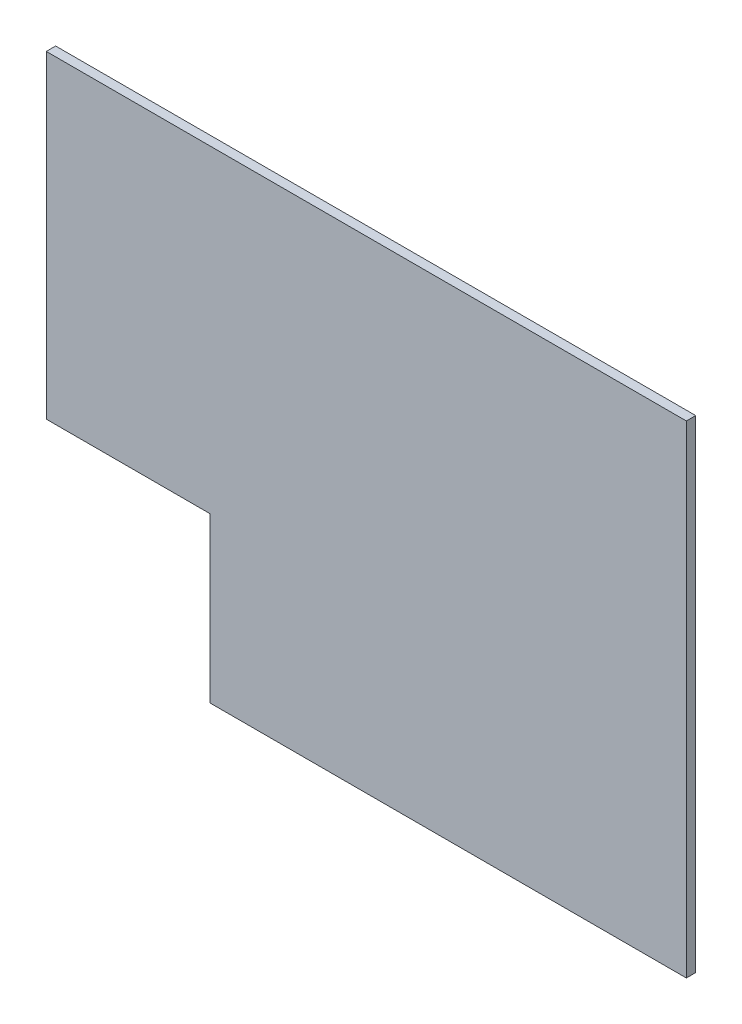
ISO-10303-21;
HEADER;
FILE_DESCRIPTION(('STEP AP214'),'2;1');
FILE_NAME('part.step','',(''),(''),'','','');
FILE_SCHEMA(('AUTOMOTIVE_DESIGN { 1 0 10303 214 1 1 1 1 }'));
ENDSEC;
DATA;
#1=APPLICATION_CONTEXT('core data for automotive mechanical design processes');
#2=APPLICATION_PROTOCOL_DEFINITION('international standard','automotive_design',2000,#1);
#3=PRODUCT_CONTEXT('',#1,'mechanical');
#4=PRODUCT('Part','Part','',(#3));
#5=PRODUCT_RELATED_PRODUCT_CATEGORY('part','',(#4));
#6=PRODUCT_DEFINITION_FORMATION('','',#4);
#7=PRODUCT_DEFINITION_CONTEXT('part definition',#1,'design');
#8=PRODUCT_DEFINITION('design','',#6,#7);
#9=PRODUCT_DEFINITION_SHAPE('','',#8);
#10=(LENGTH_UNIT() NAMED_UNIT(*) SI_UNIT(.MILLI.,.METRE.));
#11=(NAMED_UNIT(*) PLANE_ANGLE_UNIT() SI_UNIT($,.RADIAN.));
#12=(NAMED_UNIT(*) SI_UNIT($,.STERADIAN.) SOLID_ANGLE_UNIT());
#13=UNCERTAINTY_MEASURE_WITH_UNIT(LENGTH_MEASURE(1.E-05),#10,'distance_accuracy_value','');
#14=(GEOMETRIC_REPRESENTATION_CONTEXT(3) GLOBAL_UNCERTAINTY_ASSIGNED_CONTEXT((#13)) GLOBAL_UNIT_ASSIGNED_CONTEXT((#10,
#11,#12)) REPRESENTATION_CONTEXT('',''));
#15=CARTESIAN_POINT('',(0.,0.,0.));
#16=DIRECTION('',(0.,0.,1.));
#17=DIRECTION('',(1.,0.,0.));
#18=AXIS2_PLACEMENT_3D('',#15,#16,#17);
#19=CARTESIAN_POINT('',(199.461764933445,-31.9971749422643,3.));
#20=DIRECTION('',(-1.,0.,0.));
#21=DIRECTION('',(0.,-1.,0.));
#22=AXIS2_PLACEMENT_3D('',#19,#20,#21);
#23=PLANE('',#22);
#24=DIRECTION('',(0.,1.,0.));
#25=VECTOR('',#24,1.);
#26=CARTESIAN_POINT('',(199.461764933445,-31.9971749422643,0.));
#27=LINE('',#26,#25);
#28=CARTESIAN_POINT('',(199.461764933445,-31.9971749422643,0.));
#29=VERTEX_POINT('',#28);
#30=CARTESIAN_POINT('',(199.461764933445,122.502825057736,0.));
#31=VERTEX_POINT('',#30);
#32=EDGE_CURVE('E117',#29,#31,#27,.T.);
#33=ORIENTED_EDGE('',*,*,#32,.T.);
#34=DIRECTION('',(0.,0.,-1.));
#35=VECTOR('',#34,1.);
#36=CARTESIAN_POINT('',(199.461764933445,122.502825057736,3.));
#37=LINE('',#36,#35);
#38=CARTESIAN_POINT('',(199.461764933445,122.502825057736,3.));
#39=VERTEX_POINT('',#38);
#40=EDGE_CURVE('E11',#39,#31,#37,.T.);
#41=ORIENTED_EDGE('',*,*,#40,.F.);
#42=DIRECTION('',(0.,1.,0.));
#43=VECTOR('',#42,1.);
#44=CARTESIAN_POINT('',(199.461764933445,-31.9971749422643,3.));
#45=LINE('',#44,#43);
#46=CARTESIAN_POINT('',(199.461764933445,-31.9971749422643,3.));
#47=VERTEX_POINT('',#46);
#48=EDGE_CURVE('E127',#47,#39,#45,.T.);
#49=ORIENTED_EDGE('',*,*,#48,.F.);
#50=DIRECTION('',(0.,0.,-1.));
#51=VECTOR('',#50,1.);
#52=CARTESIAN_POINT('',(199.461764933445,-31.9971749422643,3.));
#53=LINE('',#52,#51);
#54=EDGE_CURVE('E113',#47,#29,#53,.T.);
#55=ORIENTED_EDGE('',*,*,#54,.T.);
#56=EDGE_LOOP('',(#33,#41,#49,#55));
#57=FACE_BOUND('',#56,.T.);
#58=ADVANCED_FACE('F33',(#57),#23,.F.);
#59=CARTESIAN_POINT('',(-5.53823506655535,122.502825057736,3.));
#60=DIRECTION('',(0.,-1.,0.));
#61=DIRECTION('',(1.,0.,0.));
#62=AXIS2_PLACEMENT_3D('',#59,#60,#61);
#63=PLANE('',#62);
#64=DIRECTION('',(-1.,0.,0.));
#65=VECTOR('',#64,1.);
#66=CARTESIAN_POINT('',(-5.53823506655535,122.502825057736,0.));
#67=LINE('',#66,#65);
#68=CARTESIAN_POINT('',(-5.53823506655535,122.502825057736,0.));
#69=VERTEX_POINT('',#68);
#70=EDGE_CURVE('E120',#31,#69,#67,.T.);
#71=ORIENTED_EDGE('',*,*,#70,.T.);
#72=DIRECTION('',(0.,0.,-1.));
#73=VECTOR('',#72,1.);
#74=CARTESIAN_POINT('',(-5.53823506655535,122.502825057736,3.));
#75=LINE('',#74,#73);
#76=CARTESIAN_POINT('',(-5.53823506655535,122.502825057736,3.));
#77=VERTEX_POINT('',#76);
#78=EDGE_CURVE('E41',#77,#69,#75,.T.);
#79=ORIENTED_EDGE('',*,*,#78,.F.);
#80=DIRECTION('',(-1.,0.,0.));
#81=VECTOR('',#80,1.);
#82=CARTESIAN_POINT('',(-5.53823506655535,122.502825057736,3.));
#83=LINE('',#82,#81);
#84=EDGE_CURVE('E86',#39,#77,#83,.T.);
#85=ORIENTED_EDGE('',*,*,#84,.F.);
#86=ORIENTED_EDGE('',*,*,#40,.T.);
#87=EDGE_LOOP('',(#71,#79,#85,#86));
#88=FACE_BOUND('',#87,.T.);
#89=ADVANCED_FACE('F151',(#88),#63,.F.);
#90=CARTESIAN_POINT('',(-5.53823506655535,122.502825057736,3.));
#91=DIRECTION('',(1.,0.,0.));
#92=DIRECTION('',(0.,0.,-1.));
#93=AXIS2_PLACEMENT_3D('',#90,#91,#92);
#94=PLANE('',#93);
#95=DIRECTION('',(0.,-1.,0.));
#96=VECTOR('',#95,1.);
#97=CARTESIAN_POINT('',(-5.53823506655535,122.502825057736,0.));
#98=LINE('',#97,#96);
#99=CARTESIAN_POINT('',(-5.53823506655535,20.5028250577357,0.));
#100=VERTEX_POINT('',#99);
#101=EDGE_CURVE('E122',#69,#100,#98,.T.);
#102=ORIENTED_EDGE('',*,*,#101,.T.);
#103=DIRECTION('',(0.,0.,-1.));
#104=VECTOR('',#103,1.);
#105=CARTESIAN_POINT('',(-5.53823506655535,20.5028250577357,3.));
#106=LINE('',#105,#104);
#107=CARTESIAN_POINT('',(-5.53823506655535,20.5028250577357,3.));
#108=VERTEX_POINT('',#107);
#109=EDGE_CURVE('E108',#108,#100,#106,.T.);
#110=ORIENTED_EDGE('',*,*,#109,.F.);
#111=DIRECTION('',(0.,-1.,0.));
#112=VECTOR('',#111,1.);
#113=CARTESIAN_POINT('',(-5.53823506655535,122.502825057736,3.));
#114=LINE('',#113,#112);
#115=EDGE_CURVE('E99',#77,#108,#114,.T.);
#116=ORIENTED_EDGE('',*,*,#115,.F.);
#117=ORIENTED_EDGE('',*,*,#78,.T.);
#118=EDGE_LOOP('',(#102,#110,#116,#117));
#119=FACE_BOUND('',#118,.T.);
#120=ADVANCED_FACE('F133',(#119),#94,.F.);
#121=CARTESIAN_POINT('',(46.9617649334447,20.5028250577357,3.));
#122=DIRECTION('',(0.,1.,0.));
#123=DIRECTION('',(0.,0.,1.));
#124=AXIS2_PLACEMENT_3D('',#121,#122,#123);
#125=PLANE('',#124);
#126=DIRECTION('',(1.,0.,0.));
#127=VECTOR('',#126,1.);
#128=CARTESIAN_POINT('',(46.9617649334447,20.5028250577357,0.));
#129=LINE('',#128,#127);
#130=CARTESIAN_POINT('',(46.9617649334447,20.5028250577357,0.));
#131=VERTEX_POINT('',#130);
#132=EDGE_CURVE('E107',#100,#131,#129,.T.);
#133=ORIENTED_EDGE('',*,*,#132,.T.);
#134=DIRECTION('',(0.,0.,-1.));
#135=VECTOR('',#134,1.);
#136=CARTESIAN_POINT('',(46.9617649334447,20.5028250577357,3.));
#137=LINE('',#136,#135);
#138=CARTESIAN_POINT('',(46.9617649334447,20.5028250577357,3.));
#139=VERTEX_POINT('',#138);
#140=EDGE_CURVE('E104',#139,#131,#137,.T.);
#141=ORIENTED_EDGE('',*,*,#140,.F.);
#142=DIRECTION('',(1.,0.,0.));
#143=VECTOR('',#142,1.);
#144=CARTESIAN_POINT('',(46.9617649334447,20.5028250577357,3.));
#145=LINE('',#144,#143);
#146=EDGE_CURVE('E93',#108,#139,#145,.T.);
#147=ORIENTED_EDGE('',*,*,#146,.F.);
#148=ORIENTED_EDGE('',*,*,#109,.T.);
#149=EDGE_LOOP('',(#133,#141,#147,#148));
#150=FACE_BOUND('',#149,.T.);
#151=ADVANCED_FACE('F105',(#150),#125,.F.);
#152=CARTESIAN_POINT('',(46.9617649334447,-31.9971749422643,3.));
#153=DIRECTION('',(1.,0.,0.));
#154=DIRECTION('',(0.,1.,0.));
#155=AXIS2_PLACEMENT_3D('',#152,#153,#154);
#156=PLANE('',#155);
#157=DIRECTION('',(0.,-1.,0.));
#158=VECTOR('',#157,1.);
#159=CARTESIAN_POINT('',(46.9617649334447,-31.9971749422643,0.));
#160=LINE('',#159,#158);
#161=CARTESIAN_POINT('',(46.9617649334447,-31.9971749422643,0.));
#162=VERTEX_POINT('',#161);
#163=EDGE_CURVE('E72',#131,#162,#160,.T.);
#164=ORIENTED_EDGE('',*,*,#163,.T.);
#165=DIRECTION('',(0.,0.,-1.));
#166=VECTOR('',#165,1.);
#167=CARTESIAN_POINT('',(46.9617649334447,-31.9971749422643,3.));
#168=LINE('',#167,#166);
#169=CARTESIAN_POINT('',(46.9617649334447,-31.9971749422643,3.));
#170=VERTEX_POINT('',#169);
#171=EDGE_CURVE('E109',#170,#162,#168,.T.);
#172=ORIENTED_EDGE('',*,*,#171,.F.);
#173=DIRECTION('',(0.,-1.,0.));
#174=VECTOR('',#173,1.);
#175=CARTESIAN_POINT('',(46.9617649334447,-31.9971749422643,3.));
#176=LINE('',#175,#174);
#177=EDGE_CURVE('E97',#139,#170,#176,.T.);
#178=ORIENTED_EDGE('',*,*,#177,.F.);
#179=ORIENTED_EDGE('',*,*,#140,.T.);
#180=EDGE_LOOP('',(#164,#172,#178,#179));
#181=FACE_BOUND('',#180,.T.);
#182=ADVANCED_FACE('F111',(#181),#156,.F.);
#183=CARTESIAN_POINT('',(46.9617649334447,-31.9971749422643,3.));
#184=DIRECTION('',(0.,1.,0.));
#185=DIRECTION('',(-1.,0.,0.));
#186=AXIS2_PLACEMENT_3D('',#183,#184,#185);
#187=PLANE('',#186);
#188=DIRECTION('',(1.,0.,0.));
#189=VECTOR('',#188,1.);
#190=CARTESIAN_POINT('',(46.9617649334447,-31.9971749422643,0.));
#191=LINE('',#190,#189);
#192=EDGE_CURVE('E78',#162,#29,#191,.T.);
#193=ORIENTED_EDGE('',*,*,#192,.T.);
#194=ORIENTED_EDGE('',*,*,#54,.F.);
#195=DIRECTION('',(1.,0.,0.));
#196=VECTOR('',#195,1.);
#197=CARTESIAN_POINT('',(46.9617649334447,-31.9971749422643,3.));
#198=LINE('',#197,#196);
#199=EDGE_CURVE('E49',#170,#47,#198,.T.);
#200=ORIENTED_EDGE('',*,*,#199,.F.);
#201=ORIENTED_EDGE('',*,*,#171,.T.);
#202=EDGE_LOOP('',(#193,#194,#200,#201));
#203=FACE_BOUND('',#202,.T.);
#204=ADVANCED_FACE('F140',(#203),#187,.F.);
#205=CARTESIAN_POINT('',(199.461764933445,122.502825057736,3.));
#206=DIRECTION('',(0.,0.,-1.));
#207=DIRECTION('',(-1.,0.,0.));
#208=AXIS2_PLACEMENT_3D('',#205,#206,#207);
#209=PLANE('',#208);
#210=ORIENTED_EDGE('',*,*,#48,.T.);
#211=ORIENTED_EDGE('',*,*,#84,.T.);
#212=ORIENTED_EDGE('',*,*,#115,.T.);
#213=ORIENTED_EDGE('',*,*,#146,.T.);
#214=ORIENTED_EDGE('',*,*,#177,.T.);
#215=ORIENTED_EDGE('',*,*,#199,.T.);
#216=EDGE_LOOP('',(#210,#211,#212,#213,#214,#215));
#217=FACE_BOUND('',#216,.T.);
#218=ADVANCED_FACE('F95',(#217),#209,.F.);
#219=CARTESIAN_POINT('',(199.461764933445,122.502825057736,0.));
#220=DIRECTION('',(0.,0.,-1.));
#221=DIRECTION('',(-1.,0.,0.));
#222=AXIS2_PLACEMENT_3D('',#219,#220,#221);
#223=PLANE('',#222);
#224=ORIENTED_EDGE('',*,*,#32,.F.);
#225=ORIENTED_EDGE('',*,*,#192,.F.);
#226=ORIENTED_EDGE('',*,*,#163,.F.);
#227=ORIENTED_EDGE('',*,*,#132,.F.);
#228=ORIENTED_EDGE('',*,*,#101,.F.);
#229=ORIENTED_EDGE('',*,*,#70,.F.);
#230=EDGE_LOOP('',(#224,#225,#226,#227,#228,#229));
#231=FACE_BOUND('',#230,.T.);
#232=ADVANCED_FACE('F136',(#231),#223,.T.);
#233=CLOSED_SHELL('',(#58,#89,#120,#151,#182,#204,#218,#232));
#234=MANIFOLD_SOLID_BREP('B2',#233);
#235=ADVANCED_BREP_SHAPE_REPRESENTATION('',(#18,#234),#14);
#236=SHAPE_DEFINITION_REPRESENTATION(#9,#235);
ENDSEC;
END-ISO-10303-21;
